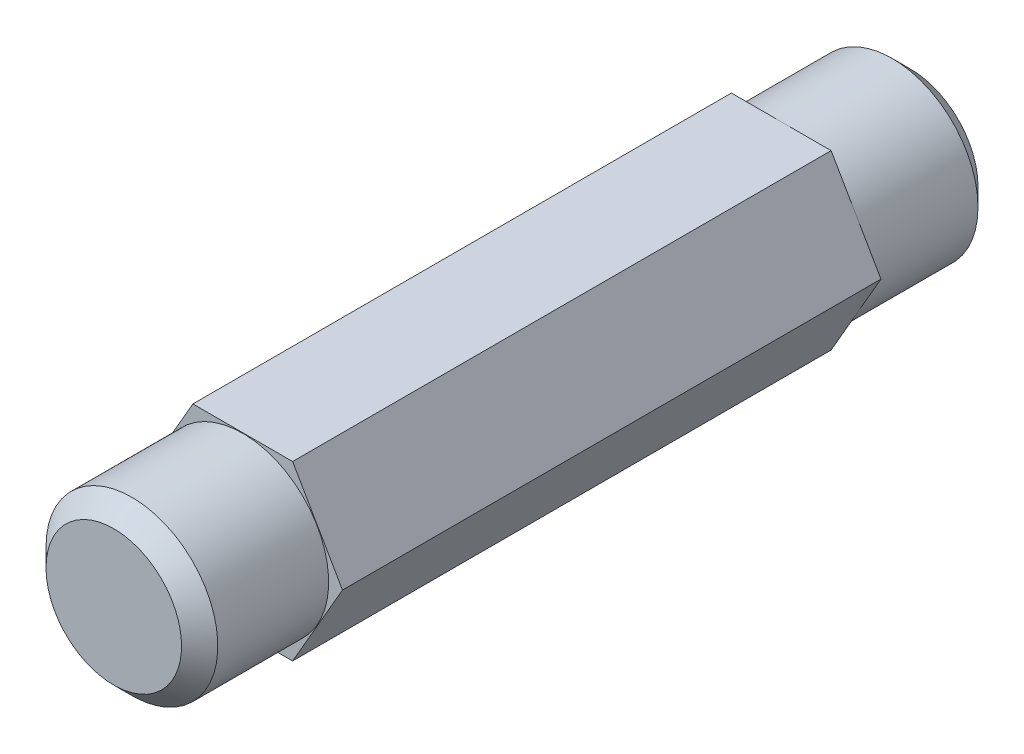
ISO-10303-21;
HEADER;
FILE_DESCRIPTION(('STEP AP214'),'2;1');
FILE_NAME('part.step','',(''),(''),'','','');
FILE_SCHEMA(('AUTOMOTIVE_DESIGN { 1 0 10303 214 1 1 1 1 }'));
ENDSEC;
DATA;
#1=APPLICATION_CONTEXT('core data for automotive mechanical design processes');
#2=APPLICATION_PROTOCOL_DEFINITION('international standard','automotive_design',2000,#1);
#3=PRODUCT_CONTEXT('',#1,'mechanical');
#4=PRODUCT('Part','Part','',(#3));
#5=PRODUCT_RELATED_PRODUCT_CATEGORY('part','',(#4));
#6=PRODUCT_DEFINITION_FORMATION('','',#4);
#7=PRODUCT_DEFINITION_CONTEXT('part definition',#1,'design');
#8=PRODUCT_DEFINITION('design','',#6,#7);
#9=PRODUCT_DEFINITION_SHAPE('','',#8);
#10=(LENGTH_UNIT() NAMED_UNIT(*) SI_UNIT(.MILLI.,.METRE.));
#11=(NAMED_UNIT(*) PLANE_ANGLE_UNIT() SI_UNIT($,.RADIAN.));
#12=(NAMED_UNIT(*) SI_UNIT($,.STERADIAN.) SOLID_ANGLE_UNIT());
#13=UNCERTAINTY_MEASURE_WITH_UNIT(LENGTH_MEASURE(1.E-05),#10,'distance_accuracy_value','');
#14=(GEOMETRIC_REPRESENTATION_CONTEXT(3) GLOBAL_UNCERTAINTY_ASSIGNED_CONTEXT((#13)) GLOBAL_UNIT_ASSIGNED_CONTEXT((#10,
#11,#12)) REPRESENTATION_CONTEXT('',''));
#15=CARTESIAN_POINT('',(0.,0.,0.));
#16=DIRECTION('',(0.,0.,1.));
#17=DIRECTION('',(1.,0.,0.));
#18=AXIS2_PLACEMENT_3D('',#15,#16,#17);
#19=CARTESIAN_POINT('',(0.,0.,21.9583));
#20=DIRECTION('',(0.,0.,1.));
#21=DIRECTION('',(1.,0.,0.));
#22=AXIS2_PLACEMENT_3D('',#19,#20,#21);
#23=PLANE('',#22);
#24=CARTESIAN_POINT('',(0.,0.,21.9582999999943));
#25=DIRECTION('',(0.,0.,-1.));
#26=DIRECTION('',(-1.,0.,0.));
#27=AXIS2_PLACEMENT_3D('',#24,#25,#26);
#28=CIRCLE('',#27,3.73710000002347);
#29=CARTESIAN_POINT('',(-3.73710000002347,0.,21.9582999999943));
#30=VERTEX_POINT('',#29);
#31=EDGE_CURVE('E19',#30,#30,#28,.T.);
#32=ORIENTED_EDGE('',*,*,#31,.F.);
#33=EDGE_LOOP('',(#32));
#34=FACE_BOUND('',#33,.T.);
#35=ADVANCED_FACE('F16',(#34),#23,.T.);
#36=CARTESIAN_POINT('',(0.,0.,-21.9583));
#37=DIRECTION('',(0.,0.,-1.));
#38=DIRECTION('',(-1.,0.,0.));
#39=AXIS2_PLACEMENT_3D('',#36,#37,#38);
#40=PLANE('',#39);
#41=CARTESIAN_POINT('',(0.,0.,-21.9583000000512));
#42=DIRECTION('',(0.,0.,1.));
#43=DIRECTION('',(1.,0.,0.));
#44=AXIS2_PLACEMENT_3D('',#41,#42,#43);
#45=CIRCLE('',#44,3.73709999996663);
#46=CARTESIAN_POINT('',(3.73709999996663,0.,-21.9583000000512));
#47=VERTEX_POINT('',#46);
#48=EDGE_CURVE('E105',#47,#47,#45,.T.);
#49=ORIENTED_EDGE('',*,*,#48,.F.);
#50=EDGE_LOOP('',(#49));
#51=FACE_BOUND('',#50,.T.);
#52=ADVANCED_FACE('F123',(#51),#40,.T.);
#53=CARTESIAN_POINT('',(0.,0.,20.9582999999043));
#54=DIRECTION('',(0.,0.,-1.));
#55=DIRECTION('',(-1.,0.,0.));
#56=AXIS2_PLACEMENT_3D('',#53,#54,#55);
#57=CONICAL_SURFACE('',#56,4.73710000011351,0.785398163397448);
#58=CARTESIAN_POINT('',(0.,0.,20.9583));
#59=DIRECTION('',(0.,0.,-1.));
#60=DIRECTION('',(-1.,0.,0.));
#61=AXIS2_PLACEMENT_3D('',#58,#59,#60);
#62=CIRCLE('',#61,4.7371);
#63=CARTESIAN_POINT('',(-4.7371,0.,20.9583));
#64=VERTEX_POINT('',#63);
#65=EDGE_CURVE('E102',#64,#64,#62,.T.);
#66=ORIENTED_EDGE('',*,*,#65,.F.);
#67=EDGE_LOOP('',(#66));
#68=FACE_BOUND('',#67,.T.);
#69=ORIENTED_EDGE('',*,*,#31,.T.);
#70=EDGE_LOOP('',(#69));
#71=FACE_BOUND('',#70,.T.);
#72=ADVANCED_FACE('F120',(#68,#71),#57,.T.);
#73=CARTESIAN_POINT('',(0.,0.,-20.958300000018));
#74=DIRECTION('',(0.,0.,1.));
#75=DIRECTION('',(1.,0.,0.));
#76=AXIS2_PLACEMENT_3D('',#73,#74,#75);
#77=CONICAL_SURFACE('',#76,4.73709999994298,0.785398163369027);
#78=CARTESIAN_POINT('',(0.,0.,-20.9583));
#79=DIRECTION('',(0.,0.,1.));
#80=DIRECTION('',(1.,0.,0.));
#81=AXIS2_PLACEMENT_3D('',#78,#79,#80);
#82=CIRCLE('',#81,4.7371);
#83=CARTESIAN_POINT('',(4.7371,0.,-20.9583));
#84=VERTEX_POINT('',#83);
#85=EDGE_CURVE('E99',#84,#84,#82,.T.);
#86=ORIENTED_EDGE('',*,*,#85,.F.);
#87=EDGE_LOOP('',(#86));
#88=FACE_BOUND('',#87,.T.);
#89=ORIENTED_EDGE('',*,*,#48,.T.);
#90=EDGE_LOOP('',(#89));
#91=FACE_BOUND('',#90,.T.);
#92=ADVANCED_FACE('F165',(#88,#91),#77,.T.);
#93=CARTESIAN_POINT('',(0.,0.,21.9583));
#94=DIRECTION('',(0.,0.,-1.));
#95=DIRECTION('',(-1.,0.,0.));
#96=AXIS2_PLACEMENT_3D('',#93,#94,#95);
#97=CYLINDRICAL_SURFACE('',#96,4.7371);
#98=CARTESIAN_POINT('',(0.,0.,14.8463));
#99=DIRECTION('',(0.,0.,-1.));
#100=DIRECTION('',(-1.,0.,0.));
#101=AXIS2_PLACEMENT_3D('',#98,#99,#100);
#102=CIRCLE('',#101,4.7371);
#103=CARTESIAN_POINT('',(-4.7371,0.,14.8463));
#104=VERTEX_POINT('',#103);
#105=EDGE_CURVE('E111',#104,#104,#102,.T.);
#106=ORIENTED_EDGE('',*,*,#105,.F.);
#107=EDGE_LOOP('',(#106));
#108=FACE_BOUND('',#107,.T.);
#109=ORIENTED_EDGE('',*,*,#65,.T.);
#110=EDGE_LOOP('',(#109));
#111=FACE_BOUND('',#110,.T.);
#112=ADVANCED_FACE('F161',(#108,#111),#97,.T.);
#113=CARTESIAN_POINT('',(0.,0.,-21.9583));
#114=DIRECTION('',(0.,0.,1.));
#115=DIRECTION('',(1.,0.,0.));
#116=AXIS2_PLACEMENT_3D('',#113,#114,#115);
#117=CYLINDRICAL_SURFACE('',#116,4.7371);
#118=CARTESIAN_POINT('',(0.,0.,-14.8463));
#119=DIRECTION('',(0.,0.,1.));
#120=DIRECTION('',(1.,0.,0.));
#121=AXIS2_PLACEMENT_3D('',#118,#119,#120);
#122=CIRCLE('',#121,4.7371);
#123=CARTESIAN_POINT('',(4.7371,0.,-14.8463));
#124=VERTEX_POINT('',#123);
#125=EDGE_CURVE('E106',#124,#124,#122,.F.);
#126=ORIENTED_EDGE('',*,*,#125,.T.);
#127=EDGE_LOOP('',(#126));
#128=FACE_BOUND('',#127,.T.);
#129=ORIENTED_EDGE('',*,*,#85,.T.);
#130=EDGE_LOOP('',(#129));
#131=FACE_BOUND('',#130,.T.);
#132=ADVANCED_FACE('F158',(#128,#131),#117,.T.);
#133=CARTESIAN_POINT('',(5.49926131403118,0.,14.8463));
#134=DIRECTION('',(-0.866025403784439,-0.5,0.));
#135=DIRECTION('',(0.5,-0.866025403784439,0.));
#136=AXIS2_PLACEMENT_3D('',#133,#134,#135);
#137=PLANE('',#136);
#138=DIRECTION('',(0.,0.,-1.));
#139=VECTOR('',#138,1.);
#140=CARTESIAN_POINT('',(2.74963065701559,4.7625,14.8463));
#141=LINE('',#140,#139);
#142=CARTESIAN_POINT('',(2.74963065701559,4.7625,-14.8463));
#143=VERTEX_POINT('',#142);
#144=CARTESIAN_POINT('',(2.74963065701559,4.7625,14.8463));
#145=VERTEX_POINT('',#144);
#146=EDGE_CURVE('E81',#143,#145,#141,.F.);
#147=ORIENTED_EDGE('',*,*,#146,.T.);
#148=DIRECTION('',(-0.5,0.866025403784439,0.));
#149=VECTOR('',#148,1.);
#150=CARTESIAN_POINT('',(5.49926131403118,0.,14.8463));
#151=LINE('',#150,#149);
#152=CARTESIAN_POINT('',(5.49926131403118,0.,14.8463));
#153=VERTEX_POINT('',#152);
#154=EDGE_CURVE('E86',#153,#145,#151,.T.);
#155=ORIENTED_EDGE('',*,*,#154,.F.);
#156=DIRECTION('',(0.,0.,1.));
#157=VECTOR('',#156,1.);
#158=CARTESIAN_POINT('',(5.49926131403118,0.,14.8463));
#159=LINE('',#158,#157);
#160=CARTESIAN_POINT('',(5.49926131403118,0.,-14.8463));
#161=VERTEX_POINT('',#160);
#162=EDGE_CURVE('E72',#153,#161,#159,.F.);
#163=ORIENTED_EDGE('',*,*,#162,.T.);
#164=DIRECTION('',(-0.5,0.866025403784439,0.));
#165=VECTOR('',#164,1.);
#166=CARTESIAN_POINT('',(5.49926131403118,0.,-14.8463));
#167=LINE('',#166,#165);
#168=EDGE_CURVE('E109',#161,#143,#167,.T.);
#169=ORIENTED_EDGE('',*,*,#168,.T.);
#170=EDGE_LOOP('',(#147,#155,#163,#169));
#171=FACE_BOUND('',#170,.T.);
#172=ADVANCED_FACE('F90',(#171),#137,.F.);
#173=CARTESIAN_POINT('',(-2.74963065701559,-4.7625,14.8463));
#174=DIRECTION('',(0.,1.,0.));
#175=DIRECTION('',(0.,0.,1.));
#176=AXIS2_PLACEMENT_3D('',#173,#174,#175);
#177=PLANE('',#176);
#178=DIRECTION('',(0.,0.,1.));
#179=VECTOR('',#178,1.);
#180=CARTESIAN_POINT('',(2.74963065701559,-4.7625,14.8463));
#181=LINE('',#180,#179);
#182=CARTESIAN_POINT('',(2.74963065701559,-4.7625,-14.8463));
#183=VERTEX_POINT('',#182);
#184=CARTESIAN_POINT('',(2.74963065701559,-4.7625,14.8463));
#185=VERTEX_POINT('',#184);
#186=EDGE_CURVE('E65',#183,#185,#181,.T.);
#187=ORIENTED_EDGE('',*,*,#186,.T.);
#188=DIRECTION('',(1.,0.,0.));
#189=VECTOR('',#188,1.);
#190=CARTESIAN_POINT('',(5.49926131403118,-4.7625,14.8463));
#191=LINE('',#190,#189);
#192=CARTESIAN_POINT('',(-2.74963065701559,-4.7625,14.8463));
#193=VERTEX_POINT('',#192);
#194=EDGE_CURVE('E88',#193,#185,#191,.T.);
#195=ORIENTED_EDGE('',*,*,#194,.F.);
#196=DIRECTION('',(0.,0.,1.));
#197=VECTOR('',#196,1.);
#198=CARTESIAN_POINT('',(-2.74963065701559,-4.7625,14.8463));
#199=LINE('',#198,#197);
#200=CARTESIAN_POINT('',(-2.74963065701559,-4.7625,-14.8463));
#201=VERTEX_POINT('',#200);
#202=EDGE_CURVE('E110',#193,#201,#199,.F.);
#203=ORIENTED_EDGE('',*,*,#202,.T.);
#204=DIRECTION('',(1.,0.,0.));
#205=VECTOR('',#204,1.);
#206=CARTESIAN_POINT('',(5.49926131403118,-4.7625,-14.8463));
#207=LINE('',#206,#205);
#208=EDGE_CURVE('E281',#201,#183,#207,.T.);
#209=ORIENTED_EDGE('',*,*,#208,.T.);
#210=EDGE_LOOP('',(#187,#195,#203,#209));
#211=FACE_BOUND('',#210,.T.);
#212=ADVANCED_FACE('F153',(#211),#177,.F.);
#213=CARTESIAN_POINT('',(2.74963065701559,-4.7625,14.8463));
#214=DIRECTION('',(-0.866025403784439,0.5,0.));
#215=DIRECTION('',(-0.5,-0.866025403784439,0.));
#216=AXIS2_PLACEMENT_3D('',#213,#214,#215);
#217=PLANE('',#216);
#218=ORIENTED_EDGE('',*,*,#162,.F.);
#219=DIRECTION('',(0.5,0.866025403784439,0.));
#220=VECTOR('',#219,1.);
#221=CARTESIAN_POINT('',(2.74963065701559,-4.7625,14.8463));
#222=LINE('',#221,#220);
#223=EDGE_CURVE('E75',#185,#153,#222,.T.);
#224=ORIENTED_EDGE('',*,*,#223,.F.);
#225=ORIENTED_EDGE('',*,*,#186,.F.);
#226=DIRECTION('',(0.5,0.866025403784439,0.));
#227=VECTOR('',#226,1.);
#228=CARTESIAN_POINT('',(2.74963065701559,-4.7625,-14.8463));
#229=LINE('',#228,#227);
#230=EDGE_CURVE('E77',#183,#161,#229,.T.);
#231=ORIENTED_EDGE('',*,*,#230,.T.);
#232=EDGE_LOOP('',(#218,#224,#225,#231));
#233=FACE_BOUND('',#232,.T.);
#234=ADVANCED_FACE('F74',(#233),#217,.F.);
#235=CARTESIAN_POINT('',(2.74963065701559,4.7625,14.8463));
#236=DIRECTION('',(0.,-1.,0.));
#237=DIRECTION('',(0.,0.,-1.));
#238=AXIS2_PLACEMENT_3D('',#235,#236,#237);
#239=PLANE('',#238);
#240=DIRECTION('',(0.,0.,1.));
#241=VECTOR('',#240,1.);
#242=CARTESIAN_POINT('',(-2.74963065701559,4.7625,14.8463));
#243=LINE('',#242,#241);
#244=CARTESIAN_POINT('',(-2.74963065701559,4.7625,-14.8463));
#245=VERTEX_POINT('',#244);
#246=CARTESIAN_POINT('',(-2.74963065701559,4.7625,14.8463));
#247=VERTEX_POINT('',#246);
#248=EDGE_CURVE('E273',#245,#247,#243,.T.);
#249=ORIENTED_EDGE('',*,*,#248,.T.);
#250=DIRECTION('',(1.,0.,0.));
#251=VECTOR('',#250,1.);
#252=CARTESIAN_POINT('',(5.49926131403118,4.7625,14.8463));
#253=LINE('',#252,#251);
#254=EDGE_CURVE('E92',#145,#247,#253,.F.);
#255=ORIENTED_EDGE('',*,*,#254,.F.);
#256=ORIENTED_EDGE('',*,*,#146,.F.);
#257=DIRECTION('',(1.,0.,0.));
#258=VECTOR('',#257,1.);
#259=CARTESIAN_POINT('',(5.49926131403118,4.7625,-14.8463));
#260=LINE('',#259,#258);
#261=EDGE_CURVE('E275',#143,#245,#260,.F.);
#262=ORIENTED_EDGE('',*,*,#261,.T.);
#263=EDGE_LOOP('',(#249,#255,#256,#262));
#264=FACE_BOUND('',#263,.T.);
#265=ADVANCED_FACE('F146',(#264),#239,.F.);
#266=CARTESIAN_POINT('',(5.49926131403118,0.,14.8463));
#267=DIRECTION('',(0.,0.,1.));
#268=DIRECTION('',(1.,0.,0.));
#269=AXIS2_PLACEMENT_3D('',#266,#267,#268);
#270=PLANE('',#269);
#271=ORIENTED_EDGE('',*,*,#105,.T.);
#272=EDGE_LOOP('',(#271));
#273=FACE_BOUND('',#272,.T.);
#274=DIRECTION('',(-0.5,0.866025403784439,0.));
#275=VECTOR('',#274,1.);
#276=CARTESIAN_POINT('',(-5.49926131403119,0.,14.8463));
#277=LINE('',#276,#275);
#278=CARTESIAN_POINT('',(-5.49926131403119,0.,14.8463));
#279=VERTEX_POINT('',#278);
#280=EDGE_CURVE('E113',#279,#193,#277,.F.);
#281=ORIENTED_EDGE('',*,*,#280,.T.);
#282=ORIENTED_EDGE('',*,*,#194,.T.);
#283=ORIENTED_EDGE('',*,*,#223,.T.);
#284=ORIENTED_EDGE('',*,*,#154,.T.);
#285=ORIENTED_EDGE('',*,*,#254,.T.);
#286=DIRECTION('',(0.5,0.866025403784439,0.));
#287=VECTOR('',#286,1.);
#288=CARTESIAN_POINT('',(-2.74963065701559,4.7625,14.8463));
#289=LINE('',#288,#287);
#290=EDGE_CURVE('E277',#247,#279,#289,.F.);
#291=ORIENTED_EDGE('',*,*,#290,.T.);
#292=EDGE_LOOP('',(#281,#282,#283,#284,#285,#291));
#293=FACE_BOUND('',#292,.T.);
#294=ADVANCED_FACE('F85',(#273,#293),#270,.T.);
#295=CARTESIAN_POINT('',(-5.49926131403119,0.,14.8463));
#296=DIRECTION('',(0.866025403784439,0.5,0.));
#297=DIRECTION('',(-0.5,0.866025403784439,0.));
#298=AXIS2_PLACEMENT_3D('',#295,#296,#297);
#299=PLANE('',#298);
#300=ORIENTED_EDGE('',*,*,#202,.F.);
#301=ORIENTED_EDGE('',*,*,#280,.F.);
#302=DIRECTION('',(0.,0.,1.));
#303=VECTOR('',#302,1.);
#304=CARTESIAN_POINT('',(-5.49926131403119,0.,14.8463));
#305=LINE('',#304,#303);
#306=CARTESIAN_POINT('',(-5.49926131403119,0.,-14.8463));
#307=VERTEX_POINT('',#306);
#308=EDGE_CURVE('E25',#279,#307,#305,.F.);
#309=ORIENTED_EDGE('',*,*,#308,.T.);
#310=DIRECTION('',(0.5,-0.866025403784439,0.));
#311=VECTOR('',#310,1.);
#312=CARTESIAN_POINT('',(-5.49926131403119,0.,-14.8463));
#313=LINE('',#312,#311);
#314=EDGE_CURVE('E33',#307,#201,#313,.T.);
#315=ORIENTED_EDGE('',*,*,#314,.T.);
#316=EDGE_LOOP('',(#300,#301,#309,#315));
#317=FACE_BOUND('',#316,.T.);
#318=ADVANCED_FACE('F137',(#317),#299,.F.);
#319=CARTESIAN_POINT('',(5.49926131403118,0.,-14.8463));
#320=DIRECTION('',(0.,0.,1.));
#321=DIRECTION('',(1.,0.,0.));
#322=AXIS2_PLACEMENT_3D('',#319,#320,#321);
#323=PLANE('',#322);
#324=ORIENTED_EDGE('',*,*,#208,.F.);
#325=ORIENTED_EDGE('',*,*,#314,.F.);
#326=DIRECTION('',(0.5,0.866025403784439,0.));
#327=VECTOR('',#326,1.);
#328=CARTESIAN_POINT('',(-2.74963065701559,4.7625,-14.8463));
#329=LINE('',#328,#327);
#330=EDGE_CURVE('E11',#307,#245,#329,.T.);
#331=ORIENTED_EDGE('',*,*,#330,.T.);
#332=ORIENTED_EDGE('',*,*,#261,.F.);
#333=ORIENTED_EDGE('',*,*,#168,.F.);
#334=ORIENTED_EDGE('',*,*,#230,.F.);
#335=EDGE_LOOP('',(#324,#325,#331,#332,#333,#334));
#336=FACE_BOUND('',#335,.T.);
#337=ORIENTED_EDGE('',*,*,#125,.F.);
#338=EDGE_LOOP('',(#337));
#339=FACE_BOUND('',#338,.T.);
#340=ADVANCED_FACE('F131',(#336,#339),#323,.F.);
#341=CARTESIAN_POINT('',(-2.74963065701559,4.7625,14.8463));
#342=DIRECTION('',(0.866025403784439,-0.5,0.));
#343=DIRECTION('',(0.5,0.866025403784439,0.));
#344=AXIS2_PLACEMENT_3D('',#341,#342,#343);
#345=PLANE('',#344);
#346=ORIENTED_EDGE('',*,*,#308,.F.);
#347=ORIENTED_EDGE('',*,*,#290,.F.);
#348=ORIENTED_EDGE('',*,*,#248,.F.);
#349=ORIENTED_EDGE('',*,*,#330,.F.);
#350=EDGE_LOOP('',(#346,#347,#348,#349));
#351=FACE_BOUND('',#350,.T.);
#352=ADVANCED_FACE('F129',(#351),#345,.F.);
#353=CLOSED_SHELL('',(#35,#52,#72,#92,#112,#132,#172,#212,#234,#265,#294,#318,#340,#352));
#354=MANIFOLD_SOLID_BREP('B1',#353);
#355=ADVANCED_BREP_SHAPE_REPRESENTATION('',(#18,#354),#14);
#356=SHAPE_DEFINITION_REPRESENTATION(#9,#355);
ENDSEC;
END-ISO-10303-21;
